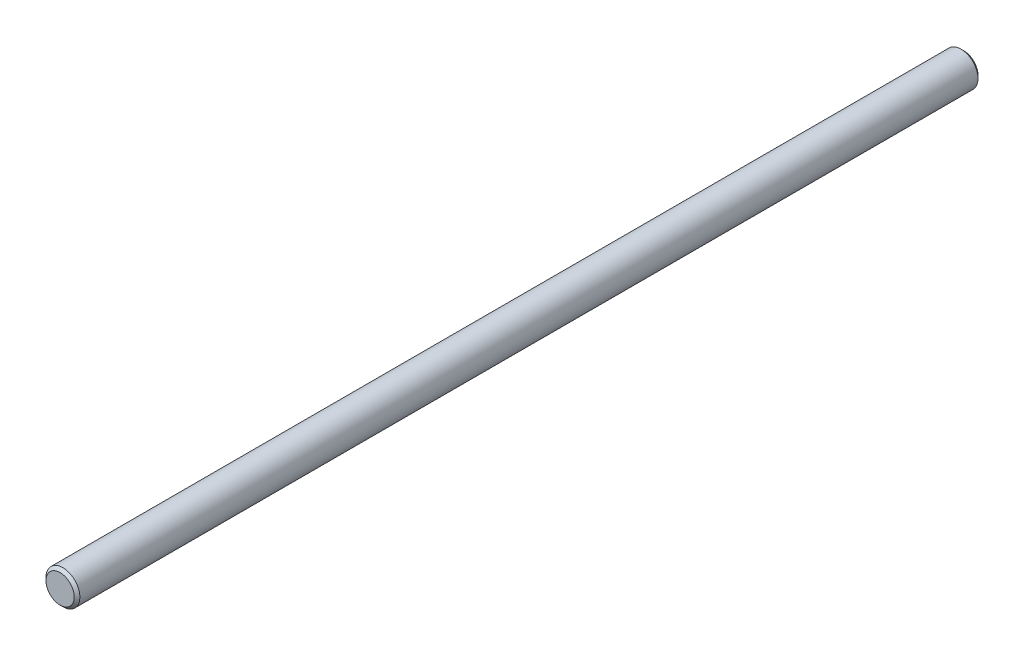
ISO-10303-21;
HEADER;
FILE_DESCRIPTION(('STEP AP214'),'2;1');
FILE_NAME('part.step','',(''),(''),'','','');
FILE_SCHEMA(('AUTOMOTIVE_DESIGN { 1 0 10303 214 1 1 1 1 }'));
ENDSEC;
DATA;
#1=APPLICATION_CONTEXT('core data for automotive mechanical design processes');
#2=APPLICATION_PROTOCOL_DEFINITION('international standard','automotive_design',2000,#1);
#3=PRODUCT_CONTEXT('',#1,'mechanical');
#4=PRODUCT('Part','Part','',(#3));
#5=PRODUCT_RELATED_PRODUCT_CATEGORY('part','',(#4));
#6=PRODUCT_DEFINITION_FORMATION('','',#4);
#7=PRODUCT_DEFINITION_CONTEXT('part definition',#1,'design');
#8=PRODUCT_DEFINITION('design','',#6,#7);
#9=PRODUCT_DEFINITION_SHAPE('','',#8);
#10=(LENGTH_UNIT() NAMED_UNIT(*) SI_UNIT(.MILLI.,.METRE.));
#11=(NAMED_UNIT(*) PLANE_ANGLE_UNIT() SI_UNIT($,.RADIAN.));
#12=(NAMED_UNIT(*) SI_UNIT($,.STERADIAN.) SOLID_ANGLE_UNIT());
#13=UNCERTAINTY_MEASURE_WITH_UNIT(LENGTH_MEASURE(1.E-05),#10,'distance_accuracy_value','');
#14=(GEOMETRIC_REPRESENTATION_CONTEXT(3) GLOBAL_UNCERTAINTY_ASSIGNED_CONTEXT((#13)) GLOBAL_UNIT_ASSIGNED_CONTEXT((#10,
#11,#12)) REPRESENTATION_CONTEXT('',''));
#15=CARTESIAN_POINT('',(0.,0.,0.));
#16=DIRECTION('',(0.,0.,1.));
#17=DIRECTION('',(1.,0.,0.));
#18=AXIS2_PLACEMENT_3D('',#15,#16,#17);
#19=CARTESIAN_POINT('',(0.,3.62077124931057,160.));
#20=DIRECTION('',(0.,0.,-1.));
#21=DIRECTION('',(-1.,0.,0.));
#22=AXIS2_PLACEMENT_3D('',#19,#20,#21);
#23=CYLINDRICAL_SURFACE('',#22,3.);
#24=CARTESIAN_POINT('',(0.,3.62077124931057,0.500000000000056));
#25=DIRECTION('',(0.,0.,1.));
#26=DIRECTION('',(1.,0.,0.));
#27=AXIS2_PLACEMENT_3D('',#24,#25,#26);
#28=CIRCLE('',#27,3.);
#29=CARTESIAN_POINT('',(3.,3.62077124931057,0.500000000000056));
#30=VERTEX_POINT('',#29);
#31=EDGE_CURVE('E42',#30,#30,#28,.T.);
#32=ORIENTED_EDGE('',*,*,#31,.T.);
#33=EDGE_LOOP('',(#32));
#34=FACE_BOUND('',#33,.T.);
#35=CARTESIAN_POINT('',(0.,3.62077124931057,159.5));
#36=DIRECTION('',(0.,0.,1.));
#37=DIRECTION('',(1.,0.,0.));
#38=AXIS2_PLACEMENT_3D('',#35,#36,#37);
#39=CIRCLE('',#38,3.);
#40=CARTESIAN_POINT('',(3.,3.62077124931057,159.5));
#41=VERTEX_POINT('',#40);
#42=EDGE_CURVE('E46',#41,#41,#39,.F.);
#43=ORIENTED_EDGE('',*,*,#42,.T.);
#44=EDGE_LOOP('',(#43));
#45=FACE_BOUND('',#44,.T.);
#46=ADVANCED_FACE('F35',(#34,#45),#23,.T.);
#47=CARTESIAN_POINT('',(0.,3.62077124931057,160.));
#48=DIRECTION('',(0.,0.,1.));
#49=DIRECTION('',(1.,0.,0.));
#50=AXIS2_PLACEMENT_3D('',#47,#48,#49);
#51=PLANE('',#50);
#52=CARTESIAN_POINT('',(0.,3.62077124931057,160.));
#53=DIRECTION('',(0.,0.,1.));
#54=DIRECTION('',(1.,0.,0.));
#55=AXIS2_PLACEMENT_3D('',#52,#53,#54);
#56=CIRCLE('',#55,2.49999999999999);
#57=CARTESIAN_POINT('',(2.49999999999999,3.62077124931057,160.));
#58=VERTEX_POINT('',#57);
#59=EDGE_CURVE('E50',#58,#58,#56,.T.);
#60=ORIENTED_EDGE('',*,*,#59,.T.);
#61=EDGE_LOOP('',(#60));
#62=FACE_BOUND('',#61,.T.);
#63=ADVANCED_FACE('F56',(#62),#51,.T.);
#64=CARTESIAN_POINT('',(0.,3.62077124931057,0.));
#65=DIRECTION('',(0.,0.,1.));
#66=DIRECTION('',(1.,0.,0.));
#67=AXIS2_PLACEMENT_3D('',#64,#65,#66);
#68=PLANE('',#67);
#69=CARTESIAN_POINT('',(0.,3.62077124931057,0.));
#70=DIRECTION('',(0.,0.,1.));
#71=DIRECTION('',(1.,0.,0.));
#72=AXIS2_PLACEMENT_3D('',#69,#70,#71);
#73=CIRCLE('',#72,2.49999999999996);
#74=CARTESIAN_POINT('',(2.49999999999996,3.62077124931057,0.));
#75=VERTEX_POINT('',#74);
#76=EDGE_CURVE('E10',#75,#75,#73,.F.);
#77=ORIENTED_EDGE('',*,*,#76,.T.);
#78=EDGE_LOOP('',(#77));
#79=FACE_BOUND('',#78,.T.);
#80=ADVANCED_FACE('F60',(#79),#68,.F.);
#81=CARTESIAN_POINT('',(0.,3.62077124931057,160.));
#82=DIRECTION('',(0.,0.,-1.));
#83=DIRECTION('',(-1.,0.,0.));
#84=AXIS2_PLACEMENT_3D('',#81,#82,#83);
#85=CONICAL_SURFACE('',#84,2.49999999999999,0.785398163397432);
#86=ORIENTED_EDGE('',*,*,#42,.F.);
#87=EDGE_LOOP('',(#86));
#88=FACE_BOUND('',#87,.T.);
#89=ORIENTED_EDGE('',*,*,#59,.F.);
#90=EDGE_LOOP('',(#89));
#91=FACE_BOUND('',#90,.T.);
#92=ADVANCED_FACE('F58',(#88,#91),#85,.T.);
#93=CARTESIAN_POINT('',(0.,3.62077124931057,0.500000000000056));
#94=DIRECTION('',(0.,0.,1.));
#95=DIRECTION('',(1.,0.,0.));
#96=AXIS2_PLACEMENT_3D('',#93,#94,#95);
#97=CONICAL_SURFACE('',#96,3.,0.785398163397432);
#98=ORIENTED_EDGE('',*,*,#76,.F.);
#99=EDGE_LOOP('',(#98));
#100=FACE_BOUND('',#99,.T.);
#101=ORIENTED_EDGE('',*,*,#31,.F.);
#102=EDGE_LOOP('',(#101));
#103=FACE_BOUND('',#102,.T.);
#104=ADVANCED_FACE('F37',(#100,#103),#97,.T.);
#105=CLOSED_SHELL('',(#46,#63,#80,#92,#104));
#106=MANIFOLD_SOLID_BREP('B2',#105);
#107=ADVANCED_BREP_SHAPE_REPRESENTATION('',(#18,#106),#14);
#108=SHAPE_DEFINITION_REPRESENTATION(#9,#107);
ENDSEC;
END-ISO-10303-21;
